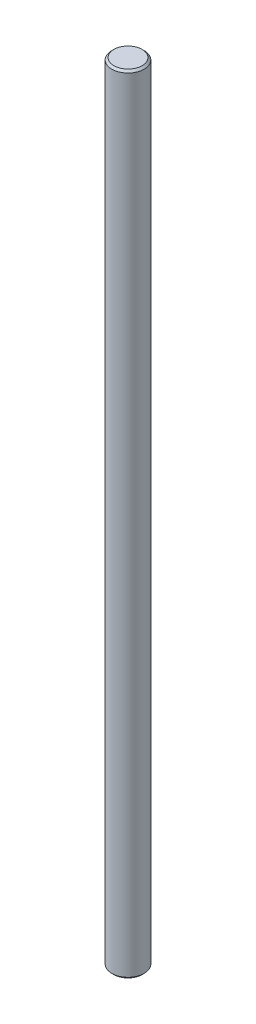
ISO-10303-21;
HEADER;
FILE_DESCRIPTION(('STEP AP214'),'2;1');
FILE_NAME('part.step','',(''),(''),'','','');
FILE_SCHEMA(('AUTOMOTIVE_DESIGN { 1 0 10303 214 1 1 1 1 }'));
ENDSEC;
DATA;
#1=APPLICATION_CONTEXT('core data for automotive mechanical design processes');
#2=APPLICATION_PROTOCOL_DEFINITION('international standard','automotive_design',2000,#1);
#3=PRODUCT_CONTEXT('',#1,'mechanical');
#4=PRODUCT('Part','Part','',(#3));
#5=PRODUCT_RELATED_PRODUCT_CATEGORY('part','',(#4));
#6=PRODUCT_DEFINITION_FORMATION('','',#4);
#7=PRODUCT_DEFINITION_CONTEXT('part definition',#1,'design');
#8=PRODUCT_DEFINITION('design','',#6,#7);
#9=PRODUCT_DEFINITION_SHAPE('','',#8);
#10=(LENGTH_UNIT() NAMED_UNIT(*) SI_UNIT(.MILLI.,.METRE.));
#11=(NAMED_UNIT(*) PLANE_ANGLE_UNIT() SI_UNIT($,.RADIAN.));
#12=(NAMED_UNIT(*) SI_UNIT($,.STERADIAN.) SOLID_ANGLE_UNIT());
#13=UNCERTAINTY_MEASURE_WITH_UNIT(LENGTH_MEASURE(1.E-05),#10,'distance_accuracy_value','');
#14=(GEOMETRIC_REPRESENTATION_CONTEXT(3) GLOBAL_UNCERTAINTY_ASSIGNED_CONTEXT((#13)) GLOBAL_UNIT_ASSIGNED_CONTEXT((#10,
#11,#12)) REPRESENTATION_CONTEXT('',''));
#15=CARTESIAN_POINT('',(0.,0.,0.));
#16=DIRECTION('',(0.,0.,1.));
#17=DIRECTION('',(1.,0.,0.));
#18=AXIS2_PLACEMENT_3D('',#15,#16,#17);
#19=CARTESIAN_POINT('',(0.,97.5,0.));
#20=DIRECTION('',(0.,-1.,0.));
#21=DIRECTION('',(0.,0.,-1.));
#22=AXIS2_PLACEMENT_3D('',#19,#20,#21);
#23=CYLINDRICAL_SURFACE('',#22,4.);
#24=CARTESIAN_POINT('',(0.,-97.,0.));
#25=DIRECTION('',(0.,1.,0.));
#26=DIRECTION('',(0.,0.,1.));
#27=AXIS2_PLACEMENT_3D('',#24,#25,#26);
#28=CIRCLE('',#27,4.);
#29=CARTESIAN_POINT('',(0.,-97.,4.));
#30=VERTEX_POINT('',#29);
#31=EDGE_CURVE('E45',#30,#30,#28,.T.);
#32=ORIENTED_EDGE('',*,*,#31,.T.);
#33=EDGE_LOOP('',(#32));
#34=FACE_BOUND('',#33,.T.);
#35=CARTESIAN_POINT('',(0.,97.,0.));
#36=DIRECTION('',(0.,1.,0.));
#37=DIRECTION('',(0.,0.,1.));
#38=AXIS2_PLACEMENT_3D('',#35,#36,#37);
#39=CIRCLE('',#38,4.);
#40=CARTESIAN_POINT('',(0.,97.,4.));
#41=VERTEX_POINT('',#40);
#42=EDGE_CURVE('E49',#41,#41,#39,.F.);
#43=ORIENTED_EDGE('',*,*,#42,.T.);
#44=EDGE_LOOP('',(#43));
#45=FACE_BOUND('',#44,.T.);
#46=ADVANCED_FACE('F33',(#34,#45),#23,.T.);
#47=CARTESIAN_POINT('',(0.,97.5,0.));
#48=DIRECTION('',(0.,1.,0.));
#49=DIRECTION('',(0.,0.,1.));
#50=AXIS2_PLACEMENT_3D('',#47,#48,#49);
#51=PLANE('',#50);
#52=CARTESIAN_POINT('',(0.,97.5,0.));
#53=DIRECTION('',(0.,1.,0.));
#54=DIRECTION('',(0.,0.,1.));
#55=AXIS2_PLACEMENT_3D('',#52,#53,#54);
#56=CIRCLE('',#55,3.50000000000003);
#57=CARTESIAN_POINT('',(0.,97.5,3.50000000000003));
#58=VERTEX_POINT('',#57);
#59=EDGE_CURVE('E10',#58,#58,#56,.T.);
#60=ORIENTED_EDGE('',*,*,#59,.T.);
#61=EDGE_LOOP('',(#60));
#62=FACE_BOUND('',#61,.T.);
#63=ADVANCED_FACE('F65',(#62),#51,.T.);
#64=CARTESIAN_POINT('',(0.,-97.5,0.));
#65=DIRECTION('',(0.,1.,0.));
#66=DIRECTION('',(0.,0.,1.));
#67=AXIS2_PLACEMENT_3D('',#64,#65,#66);
#68=PLANE('',#67);
#69=CARTESIAN_POINT('',(0.,-97.5,0.));
#70=DIRECTION('',(0.,1.,0.));
#71=DIRECTION('',(0.,0.,1.));
#72=AXIS2_PLACEMENT_3D('',#69,#70,#71);
#73=CIRCLE('',#72,3.5);
#74=CARTESIAN_POINT('',(0.,-97.5,3.5));
#75=VERTEX_POINT('',#74);
#76=EDGE_CURVE('E41',#75,#75,#73,.F.);
#77=ORIENTED_EDGE('',*,*,#76,.T.);
#78=EDGE_LOOP('',(#77));
#79=FACE_BOUND('',#78,.T.);
#80=ADVANCED_FACE('F62',(#79),#68,.F.);
#81=CARTESIAN_POINT('',(0.,-97.,0.));
#82=DIRECTION('',(0.,1.,0.));
#83=DIRECTION('',(0.,0.,1.));
#84=AXIS2_PLACEMENT_3D('',#81,#82,#83);
#85=CONICAL_SURFACE('',#84,4.,0.785398163397445);
#86=ORIENTED_EDGE('',*,*,#76,.F.);
#87=EDGE_LOOP('',(#86));
#88=FACE_BOUND('',#87,.T.);
#89=ORIENTED_EDGE('',*,*,#31,.F.);
#90=EDGE_LOOP('',(#89));
#91=FACE_BOUND('',#90,.T.);
#92=ADVANCED_FACE('F58',(#88,#91),#85,.T.);
#93=CARTESIAN_POINT('',(0.,97.5,0.));
#94=DIRECTION('',(0.,-1.,0.));
#95=DIRECTION('',(0.,0.,-1.));
#96=AXIS2_PLACEMENT_3D('',#93,#94,#95);
#97=CONICAL_SURFACE('',#96,3.50000000000003,0.785398163397459);
#98=ORIENTED_EDGE('',*,*,#42,.F.);
#99=EDGE_LOOP('',(#98));
#100=FACE_BOUND('',#99,.T.);
#101=ORIENTED_EDGE('',*,*,#59,.F.);
#102=EDGE_LOOP('',(#101));
#103=FACE_BOUND('',#102,.T.);
#104=ADVANCED_FACE('F36',(#100,#103),#97,.T.);
#105=CLOSED_SHELL('',(#46,#63,#80,#92,#104));
#106=MANIFOLD_SOLID_BREP('B2',#105);
#107=ADVANCED_BREP_SHAPE_REPRESENTATION('',(#18,#106),#14);
#108=SHAPE_DEFINITION_REPRESENTATION(#9,#107);
ENDSEC;
END-ISO-10303-21;
